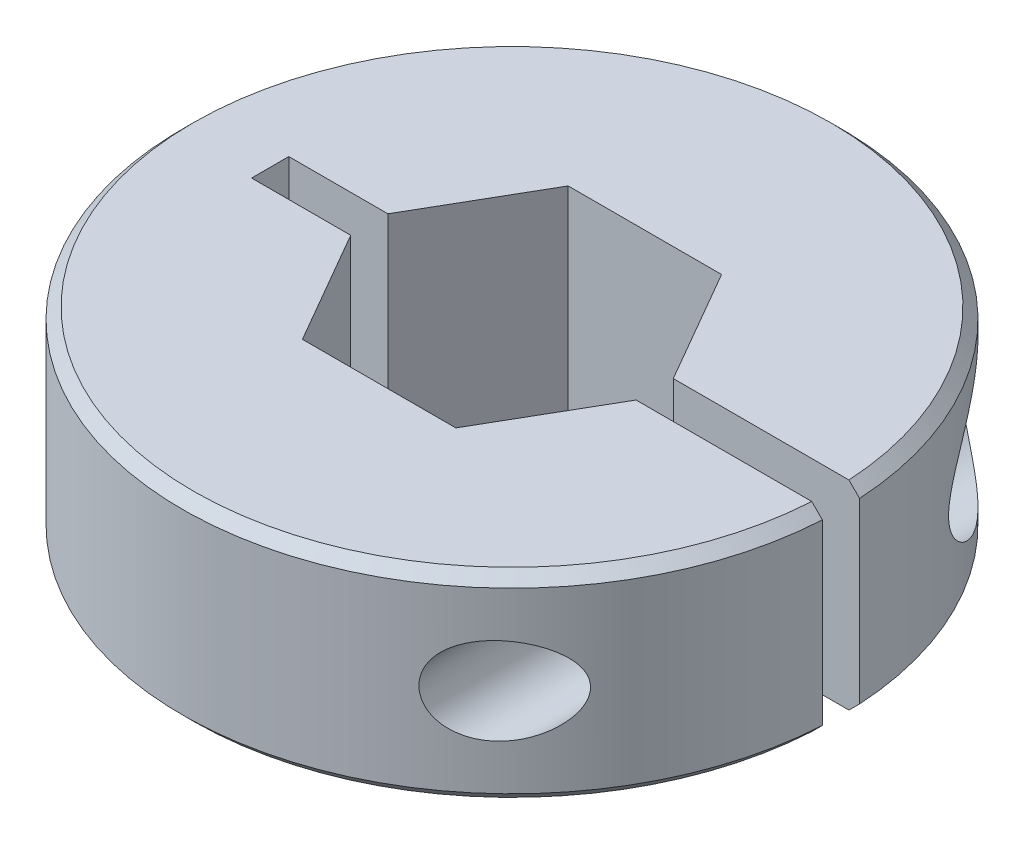
ISO-10303-21;
HEADER;
FILE_DESCRIPTION(('STEP AP214'),'2;1');
FILE_NAME('part.step','',(''),(''),'','','');
FILE_SCHEMA(('AUTOMOTIVE_DESIGN { 1 0 10303 214 1 1 1 1 }'));
ENDSEC;
DATA;
#1=APPLICATION_CONTEXT('core data for automotive mechanical design processes');
#2=APPLICATION_PROTOCOL_DEFINITION('international standard','automotive_design',2000,#1);
#3=PRODUCT_CONTEXT('',#1,'mechanical');
#4=PRODUCT('Part','Part','',(#3));
#5=PRODUCT_RELATED_PRODUCT_CATEGORY('part','',(#4));
#6=PRODUCT_DEFINITION_FORMATION('','',#4);
#7=PRODUCT_DEFINITION_CONTEXT('part definition',#1,'design');
#8=PRODUCT_DEFINITION('design','',#6,#7);
#9=PRODUCT_DEFINITION_SHAPE('','',#8);
#10=(LENGTH_UNIT() NAMED_UNIT(*) SI_UNIT(.MILLI.,.METRE.));
#11=(NAMED_UNIT(*) PLANE_ANGLE_UNIT() SI_UNIT($,.RADIAN.));
#12=(NAMED_UNIT(*) SI_UNIT($,.STERADIAN.) SOLID_ANGLE_UNIT());
#13=UNCERTAINTY_MEASURE_WITH_UNIT(LENGTH_MEASURE(1.E-05),#10,'distance_accuracy_value','');
#14=(GEOMETRIC_REPRESENTATION_CONTEXT(3) GLOBAL_UNCERTAINTY_ASSIGNED_CONTEXT((#13)) GLOBAL_UNIT_ASSIGNED_CONTEXT((#10,
#11,#12)) REPRESENTATION_CONTEXT('',''));
#15=CARTESIAN_POINT('',(0.,0.,0.));
#16=DIRECTION('',(0.,0.,1.));
#17=DIRECTION('',(1.,0.,0.));
#18=AXIS2_PLACEMENT_3D('',#15,#16,#17);
#19=CARTESIAN_POINT('',(10.7698872348561,4.7625,-4.95299999999999));
#20=DIRECTION('',(0.,0.,-1.));
#21=DIRECTION('',(-1.,0.,0.));
#22=AXIS2_PLACEMENT_3D('',#19,#20,#21);
#23=PLANE('',#22);
#24=CARTESIAN_POINT('',(10.7698872348561,4.7625,-4.95299999999999));
#25=DIRECTION('',(0.,0.,-1.));
#26=DIRECTION('',(-1.,0.,0.));
#27=AXIS2_PLACEMENT_3D('',#24,#25,#26);
#28=CIRCLE('',#27,2.0828);
#29=CARTESIAN_POINT('',(8.68708723485608,4.7625,-4.95299999999999));
#30=VERTEX_POINT('',#29);
#31=EDGE_CURVE('E367',#30,#30,#28,.F.);
#32=ORIENTED_EDGE('',*,*,#31,.T.);
#33=EDGE_LOOP('',(#32));
#34=FACE_BOUND('',#33,.T.);
#35=CARTESIAN_POINT('',(10.7698872348561,4.7625,-4.95299999999999));
#36=DIRECTION('',(0.,0.,-1.));
#37=DIRECTION('',(-1.,0.,0.));
#38=AXIS2_PLACEMENT_3D('',#35,#36,#37);
#39=CIRCLE('',#38,3.556);
#40=CARTESIAN_POINT('',(7.21388723485608,4.7625,-4.95299999999999));
#41=VERTEX_POINT('',#40);
#42=EDGE_CURVE('E19',#41,#41,#39,.T.);
#43=ORIENTED_EDGE('',*,*,#42,.T.);
#44=EDGE_LOOP('',(#43));
#45=FACE_BOUND('',#44,.T.);
#46=ADVANCED_FACE('F16',(#34,#45),#23,.T.);
#47=CARTESIAN_POINT('',(10.7698872348561,4.7625,-4.95299999999999));
#48=DIRECTION('',(0.,0.,-1.));
#49=DIRECTION('',(-1.,0.,0.));
#50=AXIS2_PLACEMENT_3D('',#47,#48,#49);
#51=CYLINDRICAL_SURFACE('',#50,3.556);
#52=ORIENTED_EDGE('',*,*,#42,.F.);
#53=EDGE_LOOP('',(#52));
#54=FACE_BOUND('',#53,.T.);
#55=CARTESIAN_POINT('',(14.3258872348561,4.7625,-6.53975985294472));
#56=CARTESIAN_POINT('',(14.3258802101327,4.85634541160308,-6.53977781823287));
#57=CARTESIAN_POINT('',(14.3221232292471,4.95030424142506,-6.54802444220115));
#58=CARTESIAN_POINT('',(14.3075403854795,5.13506724589043,-6.57982295084788));
#59=CARTESIAN_POINT('',(14.2966980026111,5.2258635244787,-6.60341060332637));
#60=CARTESIAN_POINT('',(14.2648298906135,5.42884942033144,-6.67202634115798));
#61=CARTESIAN_POINT('',(14.241717582217,5.53921812985933,-6.72137830213928));
#62=CARTESIAN_POINT('',(14.1877311128915,5.75013258396645,-6.83459686835309));
#63=CARTESIAN_POINT('',(14.1568374848652,5.85065280047014,-6.89849983784821));
#64=CARTESIAN_POINT('',(14.0924437791606,6.03298432738658,-7.02903324504136));
#65=CARTESIAN_POINT('',(14.0595097260254,6.11566187535202,-7.0947581831659));
#66=CARTESIAN_POINT('',(13.9895701736064,6.27455833367849,-7.23169053315644));
#67=CARTESIAN_POINT('',(13.9525612950944,6.35077178927176,-7.30290248045143));
#68=CARTESIAN_POINT('',(13.8749492461818,6.49761791287994,-7.44930661229992));
#69=CARTESIAN_POINT('',(13.8343390081347,6.56823906817771,-7.52450650153552));
#70=CARTESIAN_POINT('',(13.7499203733639,6.70439300444078,-7.67768578745681));
#71=CARTESIAN_POINT('',(13.7061108669219,6.76992400338089,-7.7556661437471));
#72=CARTESIAN_POINT('',(13.5756610431829,6.95206819386287,-7.98311673888825));
#73=CARTESIAN_POINT('',(13.4852602752041,7.06287792158442,-8.13510129764634));
#74=CARTESIAN_POINT('',(13.2948472891875,7.27039131057598,-8.44271083132734));
#75=CARTESIAN_POINT('',(13.1948277523302,7.36708408727628,-8.59833850904543));
#76=CARTESIAN_POINT('',(12.9855015613183,7.54733097869432,-8.91132662434683));
#77=CARTESIAN_POINT('',(12.8761822909971,7.63086679216558,-9.06868915537601));
#78=CARTESIAN_POINT('',(12.6486954291913,7.78476102571747,-9.38337396406768));
#79=CARTESIAN_POINT('',(12.5305303906523,7.85512322741985,-9.5406962402959));
#80=CARTESIAN_POINT('',(12.2803684735559,7.98496372268322,-9.86078267052133));
#81=CARTESIAN_POINT('',(12.1479974450252,8.04385354702655,-10.0234944992788));
#82=CARTESIAN_POINT('',(11.8742241429293,8.14582951431866,-10.3463578808173));
#83=CARTESIAN_POINT('',(11.7328196065666,8.18891167924842,-10.5065087794524));
#84=CARTESIAN_POINT('',(11.4419765112322,8.25759454702264,-10.8225052967782));
#85=CARTESIAN_POINT('',(11.2925602948798,8.28324138995105,-10.9783612231846));
#86=CARTESIAN_POINT('',(10.9864866313962,8.31523160616247,-11.2846593261545));
#87=CARTESIAN_POINT('',(10.8298338184708,8.32158716398237,-11.4351048605986));
#88=CARTESIAN_POINT('',(10.4661586887104,8.31137012677359,-11.7701141826685));
#89=CARTESIAN_POINT('',(10.2572299094152,8.2879398931793,-11.952549971263));
#90=CARTESIAN_POINT('',(9.94093117199582,8.22220411407008,-12.2145925982483));
#91=CARTESIAN_POINT('',(9.83503467746589,8.19520192874061,-12.2999896313674));
#92=CARTESIAN_POINT('',(9.62317637532075,8.13035964637057,-12.4664400391564));
#93=CARTESIAN_POINT('',(9.51721458016925,8.0925212072627,-12.5474940760489));
#94=CARTESIAN_POINT('',(9.23773090222422,7.9769942396801,-12.7558084686527));
#95=CARTESIAN_POINT('',(9.06498104706271,7.88937891244932,-12.8789273832935));
#96=CARTESIAN_POINT('',(8.81304787681505,7.73331152802878,-13.0514441629419));
#97=CARTESIAN_POINT('',(8.73023266669623,7.67715045689915,-13.1069453346054));
#98=CARTESIAN_POINT('',(8.56792721178135,7.55654901649832,-13.2136109068987));
#99=CARTESIAN_POINT('',(8.48843529494588,7.49211287873883,-13.2647775020027));
#100=CARTESIAN_POINT('',(8.33315341547218,7.35447221513299,-13.3628804881714));
#101=CARTESIAN_POINT('',(8.25739922141031,7.28120001721027,-13.4097786827516));
#102=CARTESIAN_POINT('',(8.11143066310858,7.12661434575874,-13.4985736305609));
#103=CARTESIAN_POINT('',(8.04121357149574,7.04530487613648,-13.5404728513841));
#104=CARTESIAN_POINT('',(7.90737910115857,6.87505974042199,-13.6190633700436));
#105=CARTESIAN_POINT('',(7.84376258835993,6.78612307651145,-13.655753984798));
#106=CARTESIAN_POINT('',(7.72422067571185,6.60129246281873,-13.7237257964545));
#107=CARTESIAN_POINT('',(7.66829377406391,6.50539987714818,-13.7550080499298));
#108=CARTESIAN_POINT('',(7.57209994669118,6.32089876366112,-13.8081644506484));
#109=CARTESIAN_POINT('',(7.53073801870365,6.23306049140412,-13.8307388776138));
#110=CARTESIAN_POINT('',(7.45506394565851,6.05345872816648,-13.8716753761884));
#111=CARTESIAN_POINT('',(7.42075082808777,5.96169578078054,-13.8900380289301));
#112=CARTESIAN_POINT('',(7.35971365562095,5.77515243900399,-13.9224750837775));
#113=CARTESIAN_POINT('',(7.33297456034102,5.68037844633708,-13.9365579886573));
#114=CARTESIAN_POINT('',(7.28738384372749,5.48846622830129,-13.9604514592805));
#115=CARTESIAN_POINT('',(7.26852856112471,5.39132912259834,-13.9702640082783));
#116=CARTESIAN_POINT('',(7.24050861719087,5.20576425952908,-13.9848045790064));
#117=CARTESIAN_POINT('',(7.2305354234247,5.11749071179964,-13.9899577106065));
#118=CARTESIAN_POINT('',(7.2172248258482,4.94031159408737,-13.9968291689679));
#119=CARTESIAN_POINT('',(7.21388723419033,4.85140604206748,-13.9985475929623));
#120=CARTESIAN_POINT('',(7.21388723553414,4.67195179789433,-13.9985476110114));
#121=CARTESIAN_POINT('',(7.21734926278969,4.58140308747079,-13.9967651380158));
#122=CARTESIAN_POINT('',(7.23115828417096,4.40093916435654,-13.9896359465601));
#123=CARTESIAN_POINT('',(7.24150793046234,4.31102420918497,-13.9842878551116));
#124=CARTESIAN_POINT('',(7.26898753870031,4.13241176431217,-13.9700237486178));
#125=CARTESIAN_POINT('',(7.2861256858743,4.04371587858107,-13.9611034262156));
#126=CARTESIAN_POINT('',(7.32698359584546,3.86825796671363,-13.9397039657145));
#127=CARTESIAN_POINT('',(7.35070587400067,3.78149669337648,-13.9272234674587));
#128=CARTESIAN_POINT('',(7.40438830197353,3.61074514482918,-13.8987574113662));
#129=CARTESIAN_POINT('',(7.43433349930276,3.52674877649907,-13.8827802505401));
#130=CARTESIAN_POINT('',(7.50014242460684,3.36185688051128,-13.8473377599988));
#131=CARTESIAN_POINT('',(7.53600833681294,3.28096251084538,-13.8278711427479));
#132=CARTESIAN_POINT('',(7.65184776953781,3.04383222389204,-13.7643195296919));
#133=CARTESIAN_POINT('',(7.74013650475195,2.89291883609898,-13.7150446815678));
#134=CARTESIAN_POINT('',(7.93749363512918,2.60519258233578,-13.6017987537623));
#135=CARTESIAN_POINT('',(8.0470510138712,2.46885980305838,-13.5374725844953));
#136=CARTESIAN_POINT('',(8.2807673635272,2.21712607174515,-13.3957849810104));
#137=CARTESIAN_POINT('',(8.40493038357992,2.10173094692881,-13.3184199294236));
#138=CARTESIAN_POINT('',(8.67522698965522,1.88317891124792,-13.1441278595841));
#139=CARTESIAN_POINT('',(8.82233027255559,1.78214829074975,-13.0460522387737));
#140=CARTESIAN_POINT('',(9.12312328605691,1.60596314647957,-12.8375084237637));
#141=CARTESIAN_POINT('',(9.27681719397595,1.53082531521556,-12.7270322958367));
#142=CARTESIAN_POINT('',(9.5422710715788,1.42297703834655,-12.528518964523));
#143=CARTESIAN_POINT('',(9.65355954695151,1.38427745464358,-12.4430058008556));
#144=CARTESIAN_POINT('',(9.87594765744132,1.3187455942787,-12.2672423634623));
#145=CARTESIAN_POINT('',(9.98704721780933,1.29191725220389,-12.1769905302291));
#146=CARTESIAN_POINT('',(10.2080911064823,1.24935182017681,-11.9922958498578));
#147=CARTESIAN_POINT('',(10.3180337647215,1.23362904337543,-11.8978477604071));
#148=CARTESIAN_POINT('',(10.5358233857399,1.21252490424971,-11.7054286637467));
#149=CARTESIAN_POINT('',(10.6436698123531,1.20714615410322,-11.6074567730327));
#150=CARTESIAN_POINT('',(10.8916930557678,1.20576866117929,-11.3757642543714));
#151=CARTESIAN_POINT('',(11.0308229562408,1.21344155421501,-11.240894457676));
#152=CARTESIAN_POINT('',(11.3031883938657,1.24404602719729,-10.9669859688471));
#153=CARTESIAN_POINT('',(11.4364218546941,1.26698293720511,-10.82794583667));
#154=CARTESIAN_POINT('',(11.6965108776215,1.32675521317298,-10.5464650170899));
#155=CARTESIAN_POINT('',(11.8233542503126,1.3636160806688,-10.404018542138));
#156=CARTESIAN_POINT('',(12.0699302638544,1.45008490416835,-10.1169212785489));
#157=CARTESIAN_POINT('',(12.1896637825458,1.49969128246165,-9.972270764823));
#158=CARTESIAN_POINT('',(12.4246139044458,1.61219837791168,-9.67805673756421));
#159=CARTESIAN_POINT('',(12.5396459395563,1.67539715104928,-9.52846011251046));
#160=CARTESIAN_POINT('',(12.7617529978898,1.81381579443926,-9.22886453170507));
#161=CARTESIAN_POINT('',(12.8688261328908,1.88903850407856,-9.07886548917138));
#162=CARTESIAN_POINT('',(13.0744553641225,2.05119024025583,-8.78014236332775));
#163=CARTESIAN_POINT('',(13.173035931681,2.13808365008095,-8.63141581069281));
#164=CARTESIAN_POINT('',(13.3616843960615,2.32420365222344,-8.3363958685354));
#165=CARTESIAN_POINT('',(13.451757264645,2.42342296200188,-8.19010109962815));
#166=CARTESIAN_POINT('',(13.6116195924323,2.62154532753919,-7.9211412543091));
#167=CARTESIAN_POINT('',(13.6825181018136,2.71876930471927,-7.79790148777794));
#168=CARTESIAN_POINT('',(13.8170094573764,2.9252659579734,-7.55703256699273));
#169=CARTESIAN_POINT('',(13.8805892465248,3.03455950675444,-7.439413652724));
#170=CARTESIAN_POINT('',(13.9696829357965,3.20983294004436,-7.26991206491311));
#171=CARTESIAN_POINT('',(13.998474219947,3.27050842058356,-7.21428219749727));
#172=CARTESIAN_POINT('',(14.053522509489,3.39590709581087,-7.10645435860726));
#173=CARTESIAN_POINT('',(14.0797786450469,3.4606316673168,-7.05425756699864));
#174=CARTESIAN_POINT('',(14.1540483459128,3.66119550007852,-6.90467874614068));
#175=CARTESIAN_POINT('',(14.1978535847609,3.80397430634081,-6.81374939024184));
#176=CARTESIAN_POINT('',(14.2528665467019,4.04043273554549,-6.69757154936107));
#177=CARTESIAN_POINT('',(14.2698701639585,4.1272661016415,-6.66118560870885));
#178=CARTESIAN_POINT('',(14.2976374490466,4.30617023176898,-6.60137540914532));
#179=CARTESIAN_POINT('',(14.3084204881001,4.3982237456726,-6.5779109225986));
#180=CARTESIAN_POINT('',(14.3189776006577,4.53642419510442,-6.55487957959468));
#181=CARTESIAN_POINT('',(14.3215598785465,4.58139897106679,-6.54923250575828));
#182=CARTESIAN_POINT('',(14.3250166647714,4.67174023972008,-6.54166770748385));
#183=CARTESIAN_POINT('',(14.3258906327239,4.71710685180244,-6.53975116311137));
#184=CARTESIAN_POINT('',(14.3258872348561,4.7625,-6.53975985294472));
#185=B_SPLINE_CURVE_WITH_KNOTS('',3,(#55,#56,#57,#58,#59,#60,#61,#62,#63,#64,#65,#66,#67,#68,
#69,#70,#71,#72,#73,#74,#75,#76,#77,#78,#79,#80,#81,#82,#83,#84,#85,#86,#87,#88,#89,#90,#91,#92,
#93,#94,#95,#96,#97,#98,#99,#100,#101,#102,#103,#104,#105,#106,#107,#108,#109,#110,#111,#112,
#113,#114,#115,#116,#117,#118,#119,#120,#121,#122,#123,#124,#125,#126,#127,#128,#129,#130,#131,
#132,#133,#134,#135,#136,#137,#138,#139,#140,#141,#142,#143,#144,#145,#146,#147,#148,#149,#150,
#151,#152,#153,#154,#155,#156,#157,#158,#159,#160,#161,#162,#163,#164,#165,#166,#167,#168,#169,
#170,#171,#172,#173,#174,#175,#176,#177,#178,#179,#180,#181,#182,#183,#184),.UNSPECIFIED.,.T.,
.F.,(4,2,2,2,2,2,2,2,2,2,2,2,2,2,2,2,2,2,2,2,2,2,2,2,2,2,2,2,2,2,2,2,2,2,2,2,2,2,2,2,2,2,2,2,2,
2,2,2,2,2,2,2,2,2,2,2,2,2,2,2,2,2,2,2,4),(0.,0.281333601056524,0.563325497773301,
0.930484951610502,1.29857224067616,1.63000003475275,1.96170478006464,2.2940755433234,
2.62656214747412,3.25168139613634,3.87728011251421,4.50374149016518,5.1300227589346,
5.78287682902516,6.43589507823465,7.08717840995805,7.73805029999987,8.56967834518819,
8.98533225696251,9.40092260817414,10.0861557152519,10.4290848834885,10.7718393856522,
11.1174090967901,11.4628075157551,11.8082511901751,12.1536273025388,12.4522671756997,
12.7508658182803,13.0488672831718,13.3467302010533,13.6133748194642,13.8800118893135,
14.1515739421068,14.4232406238874,14.6952358694689,14.9673351696913,15.2387880740547,
15.5103413457583,16.0527226675481,16.6094879885838,17.1664080277032,17.7749576039121,
18.3838987678215,18.8201103318059,19.2564663650232,19.6933837644874,20.130411484256,
20.7113367344511,21.2924649451811,21.8746626855737,22.4567883929736,23.0532899301832,
23.6499325366391,24.2447940124759,24.8393056817929,25.3555252022738,25.8726518650046,
26.1340798938323,26.3955973047107,26.9161427152879,27.2022580581599,27.4874775445238,
27.6235159493337,27.7595973797154),.UNSPECIFIED.);
#186=CARTESIAN_POINT('',(14.3258872348561,4.7625,-6.53975985294472));
#187=VERTEX_POINT('',#186);
#188=EDGE_CURVE('E213',#187,#187,#185,.T.);
#189=ORIENTED_EDGE('',*,*,#188,.F.);
#190=EDGE_LOOP('',(#189));
#191=FACE_BOUND('',#190,.T.);
#192=ADVANCED_FACE('F380',(#54,#191),#51,.F.);
#193=CARTESIAN_POINT('',(0.,0.508000000000022,0.));
#194=DIRECTION('',(0.,1.,0.));
#195=DIRECTION('',(0.,0.,1.));
#196=AXIS2_PLACEMENT_3D('',#193,#194,#195);
#197=CONICAL_SURFACE('',#196,15.748,0.785398163397448);
#198=CARTESIAN_POINT('',(15.2140487379264,0.,0.889000000000003));
#199=CARTESIAN_POINT('',(15.2988574469444,0.0846643700195372,0.889000000000003));
#200=CARTESIAN_POINT('',(15.383665009531,0.169329888362768,0.889000000000003));
#201=CARTESIAN_POINT('',(15.5532778418409,0.33866322169611,0.889000000000003));
#202=CARTESIAN_POINT('',(15.6380831115642,0.42333103668622,0.889000000000003));
#203=CARTESIAN_POINT('',(15.7228872348561,0.508000000000023,0.889000000000003));
#204=B_SPLINE_CURVE_WITH_KNOTS('',3,(#198,#199,#200,#201,#202,#203),.UNSPECIFIED.,.F.,.F.,(4,2,
4),(0.,0.359506820538772,0.719013641075381),.UNSPECIFIED.);
#205=CARTESIAN_POINT('',(15.2140487379264,0.,0.889000000000003));
#206=VERTEX_POINT('',#205);
#207=CARTESIAN_POINT('',(15.7228872348561,0.508000000000024,0.889000000000003));
#208=VERTEX_POINT('',#207);
#209=EDGE_CURVE('E135',#206,#208,#204,.T.);
#210=ORIENTED_EDGE('',*,*,#209,.T.);
#211=CARTESIAN_POINT('',(0.,0.508000000000026,0.));
#212=DIRECTION('',(0.,-1.,0.));
#213=DIRECTION('',(0.,0.,-1.));
#214=AXIS2_PLACEMENT_3D('',#211,#212,#213);
#215=CIRCLE('',#214,15.748);
#216=CARTESIAN_POINT('',(15.7228872348561,0.508000000000022,-0.888999999999997));
#217=VERTEX_POINT('',#216);
#218=EDGE_CURVE('E114',#217,#208,#215,.F.);
#219=ORIENTED_EDGE('',*,*,#218,.F.);
#220=CARTESIAN_POINT('',(15.7228872348561,0.508000000000022,-0.888999999999997));
#221=CARTESIAN_POINT('',(15.6380831115642,0.423331036686218,-0.888999999999997));
#222=CARTESIAN_POINT('',(15.5532778418409,0.338663221696107,-0.888999999999997));
#223=CARTESIAN_POINT('',(15.383665009531,0.169329888362766,-0.888999999999997));
#224=CARTESIAN_POINT('',(15.2988574469444,0.0846643700195348,-0.888999999999997));
#225=CARTESIAN_POINT('',(15.2140487379264,0.,-0.888999999999997));
#226=B_SPLINE_CURVE_WITH_KNOTS('',3,(#220,#221,#222,#223,#224,#225),.UNSPECIFIED.,.F.,.F.,(4,2,
4),(0.,0.359506820536611,0.719013641075383),.UNSPECIFIED.);
#227=CARTESIAN_POINT('',(15.2140487379264,0.,-0.888999999999997));
#228=VERTEX_POINT('',#227);
#229=EDGE_CURVE('E130',#217,#228,#226,.T.);
#230=ORIENTED_EDGE('',*,*,#229,.T.);
#231=CARTESIAN_POINT('',(0.,0.,0.));
#232=DIRECTION('',(0.,1.,0.));
#233=DIRECTION('',(0.,0.,1.));
#234=AXIS2_PLACEMENT_3D('',#231,#232,#233);
#235=CIRCLE('',#234,15.24);
#236=EDGE_CURVE('E120',#228,#206,#235,.T.);
#237=ORIENTED_EDGE('',*,*,#236,.T.);
#238=EDGE_LOOP('',(#210,#219,#230,#237));
#239=FACE_BOUND('',#238,.T.);
#240=ADVANCED_FACE('F131',(#239),#197,.T.);
#241=CARTESIAN_POINT('',(10.769887234856,4.7625,22.352));
#242=DIRECTION('',(0.,0.,-1.));
#243=DIRECTION('',(-1.,0.,0.));
#244=AXIS2_PLACEMENT_3D('',#241,#242,#243);
#245=CYLINDRICAL_SURFACE('',#244,2.0828);
#246=CARTESIAN_POINT('',(10.7698872348561,4.7625,-0.88899999999999));
#247=DIRECTION('',(0.,0.,-1.));
#248=DIRECTION('',(-1.,0.,0.));
#249=AXIS2_PLACEMENT_3D('',#246,#247,#248);
#250=CIRCLE('',#249,2.0828);
#251=CARTESIAN_POINT('',(8.68708723485607,4.7625,-0.888999999999993));
#252=VERTEX_POINT('',#251);
#253=EDGE_CURVE('E128',#252,#252,#250,.F.);
#254=ORIENTED_EDGE('',*,*,#253,.T.);
#255=EDGE_LOOP('',(#254));
#256=FACE_BOUND('',#255,.T.);
#257=ORIENTED_EDGE('',*,*,#31,.F.);
#258=EDGE_LOOP('',(#257));
#259=FACE_BOUND('',#258,.T.);
#260=ADVANCED_FACE('F379',(#256,#259),#245,.F.);
#261=CARTESIAN_POINT('',(10.769887234856,4.7625,22.352));
#262=DIRECTION('',(0.,0.,-1.));
#263=DIRECTION('',(-1.,0.,0.));
#264=AXIS2_PLACEMENT_3D('',#261,#262,#263);
#265=CYLINDRICAL_SURFACE('',#264,2.0828);
#266=CARTESIAN_POINT('',(10.7698872348561,4.7625,0.889000000000011));
#267=DIRECTION('',(0.,0.,-1.));
#268=DIRECTION('',(-1.,0.,0.));
#269=AXIS2_PLACEMENT_3D('',#266,#267,#268);
#270=CIRCLE('',#269,2.0828);
#271=CARTESIAN_POINT('',(8.68708723485607,4.7625,0.889000000000009));
#272=VERTEX_POINT('',#271);
#273=EDGE_CURVE('E171',#272,#272,#270,.T.);
#274=ORIENTED_EDGE('',*,*,#273,.T.);
#275=EDGE_LOOP('',(#274));
#276=FACE_BOUND('',#275,.T.);
#277=CARTESIAN_POINT('',(12.8526872348561,4.76249999999999,9.09988652912596));
#278=CARTESIAN_POINT('',(12.8526849657785,4.67721487433345,9.09989015730127));
#279=CARTESIAN_POINT('',(12.8473850679749,4.59191743130262,9.10738914885516));
#280=CARTESIAN_POINT('',(12.8268757677912,4.42490349779867,9.13624937123116));
#281=CARTESIAN_POINT('',(12.8116480494562,4.34319392461333,9.15763622364334));
#282=CARTESIAN_POINT('',(12.7731460874511,4.18679862866071,9.21125937839647));
#283=CARTESIAN_POINT('',(12.749974952972,4.11203778725972,9.24335652059155));
#284=CARTESIAN_POINT('',(12.6971841581248,3.96915868093151,9.3157412278843));
#285=CARTESIAN_POINT('',(12.667562047379,3.90104295439965,9.35603190487755));
#286=CARTESIAN_POINT('',(12.5821659929288,3.72903619671997,9.47082194764619));
#287=CARTESIAN_POINT('',(12.5219448615974,3.63082406313881,9.55048100626254));
#288=CARTESIAN_POINT('',(12.3913735790584,3.45052608072542,9.71930313364344));
#289=CARTESIAN_POINT('',(12.3209920143448,3.36849218393896,9.80849544623571));
#290=CARTESIAN_POINT('',(12.1903779662395,3.23717446798516,9.97006755693421));
#291=CARTESIAN_POINT('',(12.1318065562036,3.18476800611778,10.0412976765771));
#292=CARTESIAN_POINT('',(12.0107236674112,3.08786580098822,10.1858190335112));
#293=CARTESIAN_POINT('',(11.9482102729086,3.04337394487003,10.2591112632248));
#294=CARTESIAN_POINT('',(11.8196989276694,2.96201826731525,10.4069117753942));
#295=CARTESIAN_POINT('',(11.753699639284,2.92515740121988,10.4814205169753));
#296=CARTESIAN_POINT('',(11.6185971914304,2.85897569981991,10.6309871353414));
#297=CARTESIAN_POINT('',(11.5494928507538,2.82965776297729,10.7060452118553));
#298=CARTESIAN_POINT('',(11.3343476285718,2.75174520078725,10.9351058654212));
#299=CARTESIAN_POINT('',(11.1837704455942,2.71526999219497,11.0891799482674));
#300=CARTESIAN_POINT('',(10.8742004604569,2.67648722230348,11.3929003759898));
#301=CARTESIAN_POINT('',(10.7152182920593,2.67413747768004,11.5425519591022));
#302=CARTESIAN_POINT('',(10.4273387860288,2.70410307982674,11.8025191389458));
#303=CARTESIAN_POINT('',(10.2991766877212,2.72920407321781,11.9144687115806));
#304=CARTESIAN_POINT('',(10.0439408644334,2.80577892270206,12.13039736427));
#305=CARTESIAN_POINT('',(9.91686600167435,2.85722054200997,12.2343860088434));
#306=CARTESIAN_POINT('',(9.69452671838212,2.97530094960732,12.4109443030153));
#307=CARTESIAN_POINT('',(9.5980944442421,3.03663936641014,12.4855775426182));
#308=CARTESIAN_POINT('',(9.41281538424179,3.17821455196851,12.6258406497729));
#309=CARTESIAN_POINT('',(9.32395956874259,3.25842838364118,12.6914812929957));
#310=CARTESIAN_POINT('',(9.17174116425462,3.42294142277123,12.8017988028076));
#311=CARTESIAN_POINT('',(9.10658331696253,3.50444939263208,12.8481488409074));
#312=CARTESIAN_POINT('',(8.98756442859534,3.6796362908711,12.9316850097709));
#313=CARTESIAN_POINT('',(8.93370506366377,3.77331702175952,12.9688697809991));
#314=CARTESIAN_POINT('',(8.83993695948163,3.97166338067582,13.0329698826154));
#315=CARTESIAN_POINT('',(8.80012463839546,4.07639875428507,13.0598143486735));
#316=CARTESIAN_POINT('',(8.75324978441499,4.23865339258065,13.0912361340024));
#317=CARTESIAN_POINT('',(8.73976955965578,4.29356337220615,13.1002332383043));
#318=CARTESIAN_POINT('',(8.71727294203008,4.40468210033675,13.1152141752231));
#319=CARTESIAN_POINT('',(8.70825376387673,4.46089001545986,13.1211998880642));
#320=CARTESIAN_POINT('',(8.69674282101404,4.55805248110241,13.1288308903213));
#321=CARTESIAN_POINT('',(8.6931259632303,4.59882009310388,13.1312252449979));
#322=CARTESIAN_POINT('',(8.68829667247845,4.68055135699638,13.1344208194237));
#323=CARTESIAN_POINT('',(8.68708419332885,4.72151500510695,13.1352220697721));
#324=CARTESIAN_POINT('',(8.68709479315966,4.86434917419658,13.1352168365723));
#325=CARTESIAN_POINT('',(8.69460868061666,4.96633017336223,13.1302557886596));
#326=CARTESIAN_POINT('',(8.72426633821953,5.16728399460584,13.1105675409103));
#327=CARTESIAN_POINT('',(8.74643833334946,5.26625062700242,13.0958214993317));
#328=CARTESIAN_POINT('',(8.80407699753154,5.45793035577137,13.057140621899));
#329=CARTESIAN_POINT('',(8.83949732619442,5.55066393580128,13.0332378078865));
#330=CARTESIAN_POINT('',(8.92182173288028,5.72804586521482,12.9770209621949));
#331=CARTESIAN_POINT('',(8.96872362029596,5.81269575263716,12.9447085349416));
#332=CARTESIAN_POINT('',(9.07447191225792,5.97641135891996,12.8708123603317));
#333=CARTESIAN_POINT('',(9.13379203130166,6.0549982325124,12.828851032466));
#334=CARTESIAN_POINT('',(9.26034758845663,6.20079007154361,12.7377999735005));
#335=CARTESIAN_POINT('',(9.32758587089419,6.26799092567915,12.6887076793603));
#336=CARTESIAN_POINT('',(9.47820134936393,6.3998946156388,12.5766944368959));
#337=CARTESIAN_POINT('',(9.56248957397618,6.46272806581436,12.5128031064949));
#338=CARTESIAN_POINT('',(9.73566435951628,6.57330607946558,12.3785462112302));
#339=CARTESIAN_POINT('',(9.82455503629973,6.6210368560248,12.3081748060499));
#340=CARTESIAN_POINT('',(10.0490357856372,6.72213311001151,12.1262590568233));
#341=CARTESIAN_POINT('',(10.1860421300535,6.76667381693734,12.011521352593));
#342=CARTESIAN_POINT('',(10.4595051304799,6.82681253615639,11.7741759200852));
#343=CARTESIAN_POINT('',(10.595960796807,6.84237146071909,11.6515577935757));
#344=CARTESIAN_POINT('',(10.8667189941457,6.84751556094894,11.3995029297018));
#345=CARTESIAN_POINT('',(11.0009564000633,6.83669869708672,11.2699904556279));
#346=CARTESIAN_POINT('',(11.2627721773721,6.79050971665929,11.0083489315533));
#347=CARTESIAN_POINT('',(11.3903424361735,6.75510840082997,10.8762169518103));
#348=CARTESIAN_POINT('',(11.5883472391988,6.67942246150939,10.6640425246404));
#349=CARTESIAN_POINT('',(11.6615701409844,6.64649648165814,10.5838919786591));
#350=CARTESIAN_POINT('',(11.8044314372396,6.57199407465513,10.4243156059259));
#351=CARTESIAN_POINT('',(11.8740683601665,6.53041413099749,10.3448900875241));
#352=CARTESIAN_POINT('',(12.0091160089648,6.43851580677367,10.1878038521262));
#353=CARTESIAN_POINT('',(12.0745343626227,6.38821384143027,10.1101401244262));
#354=CARTESIAN_POINT('',(12.200633306139,6.27841748895369,9.95760141971698));
#355=CARTESIAN_POINT('',(12.2613179671042,6.21893113482775,9.88272407598555));
#356=CARTESIAN_POINT('',(12.3780242266411,6.0890358503295,9.73616564952523));
#357=CARTESIAN_POINT('',(12.4339608037738,6.01847446928818,9.664550552482));
#358=CARTESIAN_POINT('',(12.5386647458202,5.86613500091714,9.5283124245007));
#359=CARTESIAN_POINT('',(12.5874413246117,5.78437159578339,9.46368043611273));
#360=CARTESIAN_POINT('',(12.6663923391199,5.62700372227921,9.35764067457881));
#361=CARTESIAN_POINT('',(12.698324555151,5.55367497659437,9.31420107592099));
#362=CARTESIAN_POINT('',(12.7546284648561,5.3993506014596,9.23694979385347));
#363=CARTESIAN_POINT('',(12.7790089044199,5.31836398379192,9.20312697677835));
#364=CARTESIAN_POINT('',(12.8160066985517,5.1591789350814,9.15152371323349));
#365=CARTESIAN_POINT('',(12.8296299651249,5.08167029021318,9.1323784870118));
#366=CARTESIAN_POINT('',(12.8479646915667,4.92360829315203,9.10656744218702));
#367=CARTESIAN_POINT('',(12.8526893782084,4.84305964168429,9.09988310198082));
#368=CARTESIAN_POINT('',(12.8526872348561,4.76249999999999,9.09988652912596));
#369=B_SPLINE_CURVE_WITH_KNOTS('',3,(#277,#278,#279,#280,#281,#282,#283,#284,#285,#286,#287,
#288,#289,#290,#291,#292,#293,#294,#295,#296,#297,#298,#299,#300,#301,#302,#303,#304,#305,#306,
#307,#308,#309,#310,#311,#312,#313,#314,#315,#316,#317,#318,#319,#320,#321,#322,#323,#324,#325,
#326,#327,#328,#329,#330,#331,#332,#333,#334,#335,#336,#337,#338,#339,#340,#341,#342,#343,#344,
#345,#346,#347,#348,#349,#350,#351,#352,#353,#354,#355,#356,#357,#358,#359,#360,#361,#362,#363,
#364,#365,#366,#367,#368),.UNSPECIFIED.,.T.,.F.,(4,2,2,2,2,2,2,2,2,2,2,2,2,2,2,2,2,2,2,2,2,2,2,
2,2,2,2,2,2,2,2,2,2,2,2,2,2,2,2,2,2,2,2,2,2,4),(0.,0.255429945144551,0.511332474695327,
0.764031719665721,1.0168271193819,1.43467420618712,1.85384199615098,2.17165316529059,
2.48961999440878,2.80770973677505,3.12592152703612,3.77853328514328,4.43033826506661,
4.94452273206227,5.45807941681417,5.86603010952289,6.2734876044479,6.61460880867877,
6.95578058292145,7.29925055884435,7.47078574004859,7.64221368639682,7.76510677736735,
7.88799750787768,8.19338535656605,8.49936296562259,8.80428017701253,9.10913925744631,
9.42897981012341,9.74893560694054,10.1166394104051,10.4846779210059,11.0341750567324,
11.5844127641539,12.1430898899268,12.7024317009792,13.0424347692786,13.3825762672421,
13.7220844181505,14.0612972874523,14.4056725662771,14.7496007242765,15.0217531506765,
15.2935892022092,15.5352257185396,15.7765027840943),.UNSPECIFIED.);
#370=CARTESIAN_POINT('',(12.8526872348561,4.76249999999999,9.09988652912596));
#371=VERTEX_POINT('',#370);
#372=EDGE_CURVE('E177',#371,#371,#369,.T.);
#373=ORIENTED_EDGE('',*,*,#372,.F.);
#374=EDGE_LOOP('',(#373));
#375=FACE_BOUND('',#374,.T.);
#376=ADVANCED_FACE('F217',(#276,#375),#265,.F.);
#377=CARTESIAN_POINT('',(0.,9.525,0.));
#378=DIRECTION('',(0.,-1.,0.));
#379=DIRECTION('',(0.,0.,-1.));
#380=AXIS2_PLACEMENT_3D('',#377,#378,#379);
#381=CYLINDRICAL_SURFACE('',#380,15.748);
#382=ORIENTED_EDGE('',*,*,#218,.T.);
#383=DIRECTION('',(0.,1.,0.));
#384=VECTOR('',#383,1.);
#385=CARTESIAN_POINT('',(15.7228872348561,0.,0.889000000000003));
#386=LINE('',#385,#384);
#387=CARTESIAN_POINT('',(15.7228872348561,9.01700000000002,0.889000000000003));
#388=VERTEX_POINT('',#387);
#389=EDGE_CURVE('E159',#208,#388,#386,.T.);
#390=ORIENTED_EDGE('',*,*,#389,.T.);
#391=CARTESIAN_POINT('',(0.,9.01700000000002,0.));
#392=DIRECTION('',(0.,-1.,0.));
#393=DIRECTION('',(0.,0.,-1.));
#394=AXIS2_PLACEMENT_3D('',#391,#392,#393);
#395=CIRCLE('',#394,15.748);
#396=CARTESIAN_POINT('',(15.7228872348561,9.01700000000002,-0.888999999999997));
#397=VERTEX_POINT('',#396);
#398=EDGE_CURVE('E145',#397,#388,#395,.F.);
#399=ORIENTED_EDGE('',*,*,#398,.F.);
#400=DIRECTION('',(0.,1.,0.));
#401=VECTOR('',#400,1.);
#402=CARTESIAN_POINT('',(15.7228872348561,0.,-0.888999999999997));
#403=LINE('',#402,#401);
#404=EDGE_CURVE('E142',#397,#217,#403,.F.);
#405=ORIENTED_EDGE('',*,*,#404,.T.);
#406=EDGE_LOOP('',(#382,#390,#399,#405));
#407=FACE_BOUND('',#406,.T.);
#408=ORIENTED_EDGE('',*,*,#372,.T.);
#409=EDGE_LOOP('',(#408));
#410=FACE_BOUND('',#409,.T.);
#411=ORIENTED_EDGE('',*,*,#188,.T.);
#412=EDGE_LOOP('',(#411));
#413=FACE_BOUND('',#412,.T.);
#414=ADVANCED_FACE('F220',(#407,#410,#413),#381,.T.);
#415=CARTESIAN_POINT('',(0.,0.,0.));
#416=DIRECTION('',(0.,1.,0.));
#417=DIRECTION('',(0.,0.,1.));
#418=AXIS2_PLACEMENT_3D('',#415,#416,#417);
#419=PLANE('',#418);
#420=ORIENTED_EDGE('',*,*,#236,.F.);
#421=DIRECTION('',(-1.,0.,0.));
#422=VECTOR('',#421,1.);
#423=CARTESIAN_POINT('',(15.7228872348561,0.,-0.888999999999997));
#424=LINE('',#423,#422);
#425=CARTESIAN_POINT('',(6.81908402939866,0.,-0.888999999999998));
#426=VERTEX_POINT('',#425);
#427=EDGE_CURVE('E124',#228,#426,#424,.T.);
#428=ORIENTED_EDGE('',*,*,#427,.T.);
#429=DIRECTION('',(0.499999999999998,0.,0.86602540378444));
#430=VECTOR('',#429,1.);
#431=CARTESIAN_POINT('',(7.33234841870825,0.,0.));
#432=LINE('',#431,#430);
#433=CARTESIAN_POINT('',(3.66617420935413,0.,-6.34999999999999));
#434=VERTEX_POINT('',#433);
#435=EDGE_CURVE('E153',#434,#426,#432,.T.);
#436=ORIENTED_EDGE('',*,*,#435,.F.);
#437=DIRECTION('',(1.,0.,0.));
#438=VECTOR('',#437,1.);
#439=CARTESIAN_POINT('',(3.66617420935414,0.,-6.34999999999999));
#440=LINE('',#439,#438);
#441=CARTESIAN_POINT('',(-3.66617420935412,0.,-6.35));
#442=VERTEX_POINT('',#441);
#443=EDGE_CURVE('E307',#442,#434,#440,.T.);
#444=ORIENTED_EDGE('',*,*,#443,.F.);
#445=DIRECTION('',(0.5,0.,-0.866025403784438));
#446=VECTOR('',#445,1.);
#447=CARTESIAN_POINT('',(-3.66617420935412,0.,-6.35));
#448=LINE('',#447,#446);
#449=CARTESIAN_POINT('',(-6.81908402939867,0.,-0.888999999999996));
#450=VERTEX_POINT('',#449);
#451=EDGE_CURVE('E309',#450,#442,#448,.T.);
#452=ORIENTED_EDGE('',*,*,#451,.F.);
#453=DIRECTION('',(-1.,0.,0.));
#454=VECTOR('',#453,1.);
#455=CARTESIAN_POINT('',(15.7228872348561,0.,-0.888999999999997));
#456=LINE('',#455,#454);
#457=CARTESIAN_POINT('',(-11.557,0.,-0.888999999999997));
#458=VERTEX_POINT('',#457);
#459=EDGE_CURVE('E320',#450,#458,#456,.T.);
#460=ORIENTED_EDGE('',*,*,#459,.T.);
#461=DIRECTION('',(0.,0.,1.));
#462=VECTOR('',#461,1.);
#463=CARTESIAN_POINT('',(-11.557,0.,-0.888999999999997));
#464=LINE('',#463,#462);
#465=CARTESIAN_POINT('',(-11.557,0.,0.889000000000003));
#466=VERTEX_POINT('',#465);
#467=EDGE_CURVE('E324',#458,#466,#464,.T.);
#468=ORIENTED_EDGE('',*,*,#467,.T.);
#469=DIRECTION('',(1.,0.,0.));
#470=VECTOR('',#469,1.);
#471=CARTESIAN_POINT('',(16.4125188310913,0.,0.889000000000003));
#472=LINE('',#471,#470);
#473=CARTESIAN_POINT('',(-6.81908402939867,0.,0.889000000000003));
#474=VERTEX_POINT('',#473);
#475=EDGE_CURVE('E328',#466,#474,#472,.T.);
#476=ORIENTED_EDGE('',*,*,#475,.T.);
#477=DIRECTION('',(-0.5,0.,-0.866025403784438));
#478=VECTOR('',#477,1.);
#479=CARTESIAN_POINT('',(-7.33234841870825,0.,0.));
#480=LINE('',#479,#478);
#481=CARTESIAN_POINT('',(-3.66617420935412,0.,6.35));
#482=VERTEX_POINT('',#481);
#483=EDGE_CURVE('E330',#482,#474,#480,.T.);
#484=ORIENTED_EDGE('',*,*,#483,.F.);
#485=DIRECTION('',(-1.,0.,0.));
#486=VECTOR('',#485,1.);
#487=CARTESIAN_POINT('',(-3.66617420935412,0.,6.35));
#488=LINE('',#487,#486);
#489=CARTESIAN_POINT('',(3.66617420935411,0.,6.35000000000001));
#490=VERTEX_POINT('',#489);
#491=EDGE_CURVE('E166',#490,#482,#488,.T.);
#492=ORIENTED_EDGE('',*,*,#491,.F.);
#493=DIRECTION('',(-0.500000000000002,0.,0.866025403784437));
#494=VECTOR('',#493,1.);
#495=CARTESIAN_POINT('',(3.66617420935411,0.,6.35000000000001));
#496=LINE('',#495,#494);
#497=CARTESIAN_POINT('',(6.81908402939868,0.,0.889000000000001));
#498=VERTEX_POINT('',#497);
#499=EDGE_CURVE('E163',#498,#490,#496,.T.);
#500=ORIENTED_EDGE('',*,*,#499,.F.);
#501=DIRECTION('',(1.,0.,0.));
#502=VECTOR('',#501,1.);
#503=CARTESIAN_POINT('',(16.4125188310913,0.,0.889000000000003));
#504=LINE('',#503,#502);
#505=EDGE_CURVE('E127',#498,#206,#504,.T.);
#506=ORIENTED_EDGE('',*,*,#505,.T.);
#507=EDGE_LOOP('',(#420,#428,#436,#444,#452,#460,#468,#476,#484,#492,#500,#506));
#508=FACE_BOUND('',#507,.T.);
#509=ADVANCED_FACE('F121',(#508),#419,.F.);
#510=CARTESIAN_POINT('',(15.7228872348561,0.,-0.888999999999997));
#511=DIRECTION('',(0.,0.,-1.));
#512=DIRECTION('',(-1.,0.,0.));
#513=AXIS2_PLACEMENT_3D('',#510,#511,#512);
#514=PLANE('',#513);
#515=ORIENTED_EDGE('',*,*,#229,.F.);
#516=ORIENTED_EDGE('',*,*,#404,.F.);
#517=CARTESIAN_POINT('',(15.2140487379264,9.525,-0.888999999999997));
#518=CARTESIAN_POINT('',(15.2988574469444,9.44033562998047,-0.888999999999997));
#519=CARTESIAN_POINT('',(15.3836650095311,9.35567011163725,-0.888999999999997));
#520=CARTESIAN_POINT('',(15.5532778418409,9.18633677830392,-0.888999999999997));
#521=CARTESIAN_POINT('',(15.6380831115642,9.10166896331382,-0.888999999999997));
#522=CARTESIAN_POINT('',(15.7228872348561,9.01700000000002,-0.888999999999997));
#523=B_SPLINE_CURVE_WITH_KNOTS('',3,(#517,#518,#519,#520,#521,#522),.UNSPECIFIED.,.F.,.F.,(4,2,
4),(0.,0.359506820538739,0.719013641075316),.UNSPECIFIED.);
#524=CARTESIAN_POINT('',(15.2140487379264,9.525,-0.888999999999997));
#525=VERTEX_POINT('',#524);
#526=EDGE_CURVE('E141',#525,#397,#523,.T.);
#527=ORIENTED_EDGE('',*,*,#526,.F.);
#528=DIRECTION('',(1.,0.,0.));
#529=VECTOR('',#528,1.);
#530=CARTESIAN_POINT('',(0.,9.525,-0.888999999999997));
#531=LINE('',#530,#529);
#532=CARTESIAN_POINT('',(6.81908402939866,9.525,-0.888999999999997));
#533=VERTEX_POINT('',#532);
#534=EDGE_CURVE('E155',#533,#525,#531,.T.);
#535=ORIENTED_EDGE('',*,*,#534,.F.);
#536=DIRECTION('',(0.,1.,0.));
#537=VECTOR('',#536,1.);
#538=CARTESIAN_POINT('',(6.81908402939866,9.525,-0.888999999999998));
#539=LINE('',#538,#537);
#540=EDGE_CURVE('E139',#426,#533,#539,.T.);
#541=ORIENTED_EDGE('',*,*,#540,.F.);
#542=ORIENTED_EDGE('',*,*,#427,.F.);
#543=EDGE_LOOP('',(#515,#516,#527,#535,#541,#542));
#544=FACE_BOUND('',#543,.T.);
#545=ORIENTED_EDGE('',*,*,#253,.F.);
#546=EDGE_LOOP('',(#545));
#547=FACE_BOUND('',#546,.T.);
#548=ADVANCED_FACE('F136',(#544,#547),#514,.F.);
#549=CARTESIAN_POINT('',(0.,9.01700000000002,0.));
#550=DIRECTION('',(0.,-1.,0.));
#551=DIRECTION('',(0.,0.,-1.));
#552=AXIS2_PLACEMENT_3D('',#549,#550,#551);
#553=CONICAL_SURFACE('',#552,15.748,0.785398163397448);
#554=ORIENTED_EDGE('',*,*,#398,.T.);
#555=CARTESIAN_POINT('',(15.7228872348561,9.01700000000002,0.889000000000003));
#556=CARTESIAN_POINT('',(15.6380831115642,9.10166896331382,0.889000000000003));
#557=CARTESIAN_POINT('',(15.5532778418409,9.18633677830392,0.889000000000003));
#558=CARTESIAN_POINT('',(15.3836650095311,9.35567011163725,0.889000000000003));
#559=CARTESIAN_POINT('',(15.2988574469444,9.44033562998047,0.889000000000003));
#560=CARTESIAN_POINT('',(15.2140487379264,9.525,0.889000000000003));
#561=B_SPLINE_CURVE_WITH_KNOTS('',3,(#555,#556,#557,#558,#559,#560),.UNSPECIFIED.,.F.,.F.,(4,2,
4),(0.,0.35950682053658,0.719013641075319),.UNSPECIFIED.);
#562=CARTESIAN_POINT('',(15.2140487379264,9.525,0.889000000000003));
#563=VERTEX_POINT('',#562);
#564=EDGE_CURVE('E160',#388,#563,#561,.T.);
#565=ORIENTED_EDGE('',*,*,#564,.T.);
#566=CARTESIAN_POINT('',(0.,9.525,0.));
#567=DIRECTION('',(0.,-1.,0.));
#568=DIRECTION('',(0.,0.,-1.));
#569=AXIS2_PLACEMENT_3D('',#566,#567,#568);
#570=CIRCLE('',#569,15.24);
#571=EDGE_CURVE('E180',#525,#563,#570,.F.);
#572=ORIENTED_EDGE('',*,*,#571,.F.);
#573=ORIENTED_EDGE('',*,*,#526,.T.);
#574=EDGE_LOOP('',(#554,#565,#572,#573));
#575=FACE_BOUND('',#574,.T.);
#576=ADVANCED_FACE('F193',(#575),#553,.T.);
#577=CARTESIAN_POINT('',(16.4125188310913,0.,0.889000000000003));
#578=DIRECTION('',(0.,0.,1.));
#579=DIRECTION('',(1.,0.,0.));
#580=AXIS2_PLACEMENT_3D('',#577,#578,#579);
#581=PLANE('',#580);
#582=ORIENTED_EDGE('',*,*,#209,.F.);
#583=ORIENTED_EDGE('',*,*,#505,.F.);
#584=DIRECTION('',(0.,1.,0.));
#585=VECTOR('',#584,1.);
#586=CARTESIAN_POINT('',(6.81908402939868,9.525,0.888999999999999));
#587=LINE('',#586,#585);
#588=CARTESIAN_POINT('',(6.81908402939868,9.525,0.889000000000002));
#589=VERTEX_POINT('',#588);
#590=EDGE_CURVE('E167',#589,#498,#587,.F.);
#591=ORIENTED_EDGE('',*,*,#590,.F.);
#592=DIRECTION('',(1.,0.,0.));
#593=VECTOR('',#592,1.);
#594=CARTESIAN_POINT('',(0.,9.525,0.889000000000003));
#595=LINE('',#594,#593);
#596=EDGE_CURVE('E182',#563,#589,#595,.F.);
#597=ORIENTED_EDGE('',*,*,#596,.F.);
#598=ORIENTED_EDGE('',*,*,#564,.F.);
#599=ORIENTED_EDGE('',*,*,#389,.F.);
#600=EDGE_LOOP('',(#582,#583,#591,#597,#598,#599));
#601=FACE_BOUND('',#600,.T.);
#602=ORIENTED_EDGE('',*,*,#273,.F.);
#603=EDGE_LOOP('',(#602));
#604=FACE_BOUND('',#603,.T.);
#605=ADVANCED_FACE('F190',(#601,#604),#581,.F.);
#606=CARTESIAN_POINT('',(3.66617420935411,9.525,6.35000000000001));
#607=DIRECTION('',(-0.866025403784437,0.,-0.500000000000002));
#608=DIRECTION('',(-0.500000000000002,0.,0.866025403784437));
#609=AXIS2_PLACEMENT_3D('',#606,#607,#608);
#610=PLANE('',#609);
#611=DIRECTION('',(0.,1.,0.));
#612=VECTOR('',#611,1.);
#613=CARTESIAN_POINT('',(3.66617420935411,9.525,6.35000000000001));
#614=LINE('',#613,#612);
#615=CARTESIAN_POINT('',(3.66617420935411,9.525,6.35000000000001));
#616=VERTEX_POINT('',#615);
#617=EDGE_CURVE('E277',#616,#490,#614,.F.);
#618=ORIENTED_EDGE('',*,*,#617,.F.);
#619=DIRECTION('',(-0.500000000000003,0.,0.866025403784437));
#620=VECTOR('',#619,1.);
#621=CARTESIAN_POINT('',(6.81908402939868,9.525,0.889000000000001));
#622=LINE('',#621,#620);
#623=EDGE_CURVE('E281',#589,#616,#622,.T.);
#624=ORIENTED_EDGE('',*,*,#623,.F.);
#625=ORIENTED_EDGE('',*,*,#590,.T.);
#626=ORIENTED_EDGE('',*,*,#499,.T.);
#627=EDGE_LOOP('',(#618,#624,#625,#626));
#628=FACE_BOUND('',#627,.T.);
#629=ADVANCED_FACE('F267',(#628),#610,.T.);
#630=CARTESIAN_POINT('',(-3.66617420935412,9.525,6.35));
#631=DIRECTION('',(0.,0.,-1.));
#632=DIRECTION('',(-1.,0.,0.));
#633=AXIS2_PLACEMENT_3D('',#630,#631,#632);
#634=PLANE('',#633);
#635=DIRECTION('',(1.,0.,0.));
#636=VECTOR('',#635,1.);
#637=CARTESIAN_POINT('',(0.,9.525,6.35000000000001));
#638=LINE('',#637,#636);
#639=CARTESIAN_POINT('',(-3.66617420935412,9.525,6.35));
#640=VERTEX_POINT('',#639);
#641=EDGE_CURVE('E286',#616,#640,#638,.F.);
#642=ORIENTED_EDGE('',*,*,#641,.F.);
#643=ORIENTED_EDGE('',*,*,#617,.T.);
#644=ORIENTED_EDGE('',*,*,#491,.T.);
#645=DIRECTION('',(0.,1.,0.));
#646=VECTOR('',#645,1.);
#647=CARTESIAN_POINT('',(-3.66617420935412,9.525,6.35));
#648=LINE('',#647,#646);
#649=EDGE_CURVE('E283',#640,#482,#648,.F.);
#650=ORIENTED_EDGE('',*,*,#649,.F.);
#651=EDGE_LOOP('',(#642,#643,#644,#650));
#652=FACE_BOUND('',#651,.T.);
#653=ADVANCED_FACE('F264',(#652),#634,.T.);
#654=CARTESIAN_POINT('',(-7.33234841870825,9.525,0.));
#655=DIRECTION('',(0.866025403784438,0.,-0.5));
#656=DIRECTION('',(-0.5,0.,-0.866025403784438));
#657=AXIS2_PLACEMENT_3D('',#654,#655,#656);
#658=PLANE('',#657);
#659=ORIENTED_EDGE('',*,*,#649,.T.);
#660=ORIENTED_EDGE('',*,*,#483,.T.);
#661=DIRECTION('',(0.,1.,0.));
#662=VECTOR('',#661,1.);
#663=CARTESIAN_POINT('',(-6.81908402939867,0.,0.889000000000003));
#664=LINE('',#663,#662);
#665=CARTESIAN_POINT('',(-6.81908402939867,9.525,0.889000000000003));
#666=VERTEX_POINT('',#665);
#667=EDGE_CURVE('E326',#474,#666,#664,.T.);
#668=ORIENTED_EDGE('',*,*,#667,.T.);
#669=DIRECTION('',(-0.5,0.,-0.866025403784438));
#670=VECTOR('',#669,1.);
#671=CARTESIAN_POINT('',(-3.66617420935412,9.525,6.35));
#672=LINE('',#671,#670);
#673=EDGE_CURVE('E290',#640,#666,#672,.T.);
#674=ORIENTED_EDGE('',*,*,#673,.F.);
#675=EDGE_LOOP('',(#659,#660,#668,#674));
#676=FACE_BOUND('',#675,.T.);
#677=ADVANCED_FACE('F260',(#676),#658,.T.);
#678=CARTESIAN_POINT('',(16.4125188310913,0.,0.889000000000003));
#679=DIRECTION('',(0.,0.,1.));
#680=DIRECTION('',(1.,0.,0.));
#681=AXIS2_PLACEMENT_3D('',#678,#679,#680);
#682=PLANE('',#681);
#683=ORIENTED_EDGE('',*,*,#475,.F.);
#684=DIRECTION('',(0.,1.,0.));
#685=VECTOR('',#684,1.);
#686=CARTESIAN_POINT('',(-11.557,0.,0.889000000000003));
#687=LINE('',#686,#685);
#688=CARTESIAN_POINT('',(-11.557,9.525,0.889000000000003));
#689=VERTEX_POINT('',#688);
#690=EDGE_CURVE('E322',#466,#689,#687,.T.);
#691=ORIENTED_EDGE('',*,*,#690,.T.);
#692=DIRECTION('',(1.,0.,0.));
#693=VECTOR('',#692,1.);
#694=CARTESIAN_POINT('',(0.,9.525,0.889000000000003));
#695=LINE('',#694,#693);
#696=EDGE_CURVE('E337',#666,#689,#695,.F.);
#697=ORIENTED_EDGE('',*,*,#696,.F.);
#698=ORIENTED_EDGE('',*,*,#667,.F.);
#699=EDGE_LOOP('',(#683,#691,#697,#698));
#700=FACE_BOUND('',#699,.T.);
#701=ADVANCED_FACE('F256',(#700),#682,.F.);
#702=CARTESIAN_POINT('',(-11.557,0.,-0.888999999999997));
#703=DIRECTION('',(-1.,0.,0.));
#704=DIRECTION('',(0.,0.,1.));
#705=AXIS2_PLACEMENT_3D('',#702,#703,#704);
#706=PLANE('',#705);
#707=ORIENTED_EDGE('',*,*,#690,.F.);
#708=ORIENTED_EDGE('',*,*,#467,.F.);
#709=DIRECTION('',(0.,1.,0.));
#710=VECTOR('',#709,1.);
#711=CARTESIAN_POINT('',(-11.557,0.,-0.888999999999997));
#712=LINE('',#711,#710);
#713=CARTESIAN_POINT('',(-11.557,9.525,-0.888999999999997));
#714=VERTEX_POINT('',#713);
#715=EDGE_CURVE('E318',#458,#714,#712,.T.);
#716=ORIENTED_EDGE('',*,*,#715,.T.);
#717=DIRECTION('',(0.,0.,1.));
#718=VECTOR('',#717,1.);
#719=CARTESIAN_POINT('',(-11.557,9.525,0.));
#720=LINE('',#719,#718);
#721=EDGE_CURVE('E339',#689,#714,#720,.F.);
#722=ORIENTED_EDGE('',*,*,#721,.F.);
#723=EDGE_LOOP('',(#707,#708,#716,#722));
#724=FACE_BOUND('',#723,.T.);
#725=ADVANCED_FACE('F252',(#724),#706,.F.);
#726=CARTESIAN_POINT('',(15.7228872348561,0.,-0.888999999999997));
#727=DIRECTION('',(0.,0.,-1.));
#728=DIRECTION('',(-1.,0.,0.));
#729=AXIS2_PLACEMENT_3D('',#726,#727,#728);
#730=PLANE('',#729);
#731=DIRECTION('',(1.,0.,0.));
#732=VECTOR('',#731,1.);
#733=CARTESIAN_POINT('',(0.,9.525,-0.888999999999997));
#734=LINE('',#733,#732);
#735=CARTESIAN_POINT('',(-6.81908402939867,9.525,-0.888999999999996));
#736=VERTEX_POINT('',#735);
#737=EDGE_CURVE('E359',#714,#736,#734,.T.);
#738=ORIENTED_EDGE('',*,*,#737,.F.);
#739=ORIENTED_EDGE('',*,*,#715,.F.);
#740=ORIENTED_EDGE('',*,*,#459,.F.);
#741=DIRECTION('',(0.,1.,0.));
#742=VECTOR('',#741,1.);
#743=CARTESIAN_POINT('',(-6.81908402939867,9.525,-0.888999999999996));
#744=LINE('',#743,#742);
#745=EDGE_CURVE('E315',#736,#450,#744,.F.);
#746=ORIENTED_EDGE('',*,*,#745,.F.);
#747=EDGE_LOOP('',(#738,#739,#740,#746));
#748=FACE_BOUND('',#747,.T.);
#749=ADVANCED_FACE('F248',(#748),#730,.F.);
#750=CARTESIAN_POINT('',(-3.66617420935412,9.525,-6.35));
#751=DIRECTION('',(0.866025403784438,0.,0.5));
#752=DIRECTION('',(0.5,0.,-0.866025403784438));
#753=AXIS2_PLACEMENT_3D('',#750,#751,#752);
#754=PLANE('',#753);
#755=DIRECTION('',(0.,1.,0.));
#756=VECTOR('',#755,1.);
#757=CARTESIAN_POINT('',(-3.66617420935412,9.525,-6.35));
#758=LINE('',#757,#756);
#759=CARTESIAN_POINT('',(-3.66617420935412,9.525,-6.35));
#760=VERTEX_POINT('',#759);
#761=EDGE_CURVE('E303',#760,#442,#758,.F.);
#762=ORIENTED_EDGE('',*,*,#761,.F.);
#763=DIRECTION('',(0.500000000000001,0.,-0.866025403784438));
#764=VECTOR('',#763,1.);
#765=CARTESIAN_POINT('',(-6.81908402939868,9.525,-0.888999999999996));
#766=LINE('',#765,#764);
#767=EDGE_CURVE('E360',#736,#760,#766,.T.);
#768=ORIENTED_EDGE('',*,*,#767,.F.);
#769=ORIENTED_EDGE('',*,*,#745,.T.);
#770=ORIENTED_EDGE('',*,*,#451,.T.);
#771=EDGE_LOOP('',(#762,#768,#769,#770));
#772=FACE_BOUND('',#771,.T.);
#773=ADVANCED_FACE('F245',(#772),#754,.T.);
#774=CARTESIAN_POINT('',(3.66617420935414,9.525,-6.34999999999999));
#775=DIRECTION('',(0.,0.,1.));
#776=DIRECTION('',(1.,0.,0.));
#777=AXIS2_PLACEMENT_3D('',#774,#775,#776);
#778=PLANE('',#777);
#779=DIRECTION('',(1.,0.,0.));
#780=VECTOR('',#779,1.);
#781=CARTESIAN_POINT('',(0.,9.525,-6.35));
#782=LINE('',#781,#780);
#783=CARTESIAN_POINT('',(3.66617420935413,9.525,-6.34999999999999));
#784=VERTEX_POINT('',#783);
#785=EDGE_CURVE('E25',#760,#784,#782,.T.);
#786=ORIENTED_EDGE('',*,*,#785,.F.);
#787=ORIENTED_EDGE('',*,*,#761,.T.);
#788=ORIENTED_EDGE('',*,*,#443,.T.);
#789=DIRECTION('',(0.,1.,0.));
#790=VECTOR('',#789,1.);
#791=CARTESIAN_POINT('',(3.66617420935413,9.525,-6.34999999999999));
#792=LINE('',#791,#790);
#793=EDGE_CURVE('E34',#784,#434,#792,.F.);
#794=ORIENTED_EDGE('',*,*,#793,.F.);
#795=EDGE_LOOP('',(#786,#787,#788,#794));
#796=FACE_BOUND('',#795,.T.);
#797=ADVANCED_FACE('F238',(#796),#778,.T.);
#798=CARTESIAN_POINT('',(7.33234841870825,9.525,0.));
#799=DIRECTION('',(-0.86602540378444,0.,0.499999999999998));
#800=DIRECTION('',(0.499999999999998,0.,0.86602540378444));
#801=AXIS2_PLACEMENT_3D('',#798,#799,#800);
#802=PLANE('',#801);
#803=ORIENTED_EDGE('',*,*,#793,.T.);
#804=ORIENTED_EDGE('',*,*,#435,.T.);
#805=ORIENTED_EDGE('',*,*,#540,.T.);
#806=DIRECTION('',(0.499999999999998,0.,0.866025403784439));
#807=VECTOR('',#806,1.);
#808=CARTESIAN_POINT('',(3.66617420935414,9.525,-6.34999999999999));
#809=LINE('',#808,#807);
#810=EDGE_CURVE('E11',#784,#533,#809,.T.);
#811=ORIENTED_EDGE('',*,*,#810,.F.);
#812=EDGE_LOOP('',(#803,#804,#805,#811));
#813=FACE_BOUND('',#812,.T.);
#814=ADVANCED_FACE('F232',(#813),#802,.T.);
#815=CARTESIAN_POINT('',(0.,9.525,0.));
#816=DIRECTION('',(0.,1.,0.));
#817=DIRECTION('',(0.,0.,1.));
#818=AXIS2_PLACEMENT_3D('',#815,#816,#817);
#819=PLANE('',#818);
#820=ORIENTED_EDGE('',*,*,#785,.T.);
#821=ORIENTED_EDGE('',*,*,#810,.T.);
#822=ORIENTED_EDGE('',*,*,#534,.T.);
#823=ORIENTED_EDGE('',*,*,#571,.T.);
#824=ORIENTED_EDGE('',*,*,#596,.T.);
#825=ORIENTED_EDGE('',*,*,#623,.T.);
#826=ORIENTED_EDGE('',*,*,#641,.T.);
#827=ORIENTED_EDGE('',*,*,#673,.T.);
#828=ORIENTED_EDGE('',*,*,#696,.T.);
#829=ORIENTED_EDGE('',*,*,#721,.T.);
#830=ORIENTED_EDGE('',*,*,#737,.T.);
#831=ORIENTED_EDGE('',*,*,#767,.T.);
#832=EDGE_LOOP('',(#820,#821,#822,#823,#824,#825,#826,#827,#828,#829,#830,#831));
#833=FACE_BOUND('',#832,.T.);
#834=ADVANCED_FACE('F230',(#833),#819,.T.);
#835=CLOSED_SHELL('',(#46,#192,#240,#260,#376,#414,#509,#548,#576,#605,#629,#653,#677,#701,#725,
#749,#773,#797,#814,#834));
#836=MANIFOLD_SOLID_BREP('B1',#835);
#837=ADVANCED_BREP_SHAPE_REPRESENTATION('',(#18,#836),#14);
#838=SHAPE_DEFINITION_REPRESENTATION(#9,#837);
ENDSEC;
END-ISO-10303-21;
